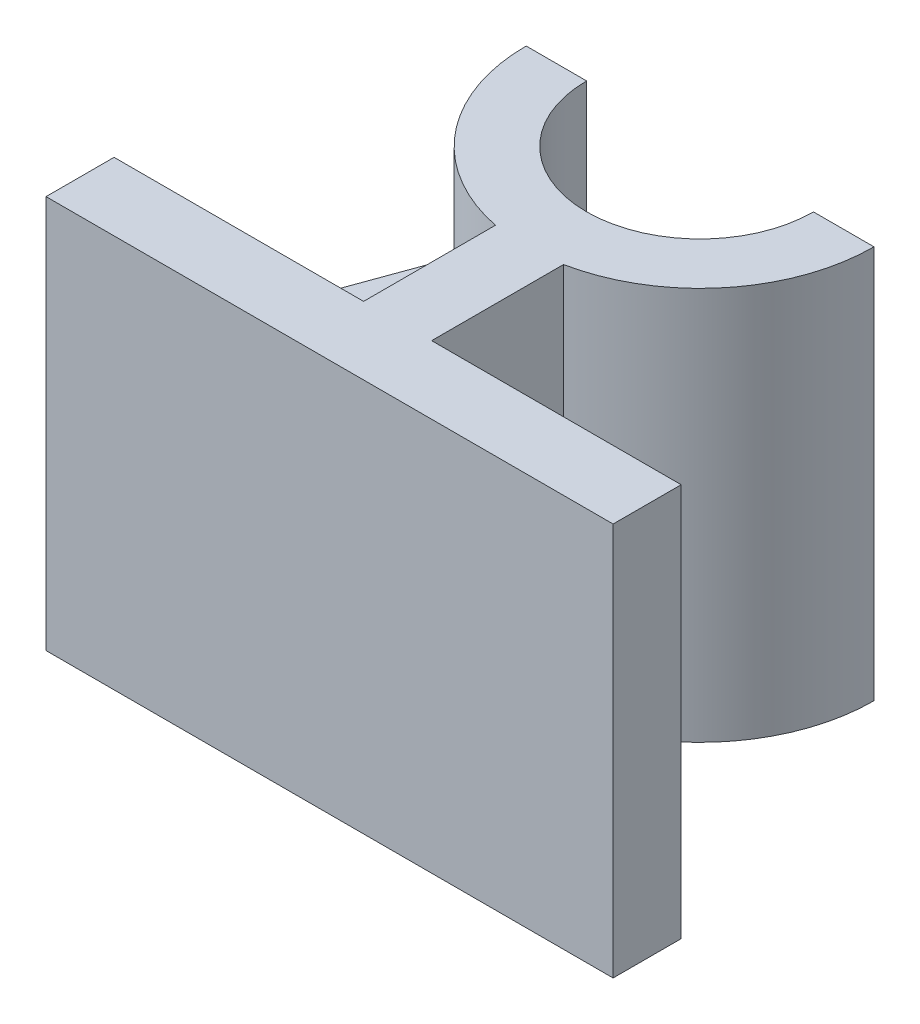
ISO-10303-21;
HEADER;
FILE_DESCRIPTION(('STEP AP214'),'2;1');
FILE_NAME('part.step','',(''),(''),'','','');
FILE_SCHEMA(('AUTOMOTIVE_DESIGN { 1 0 10303 214 1 1 1 1 }'));
ENDSEC;
DATA;
#1=APPLICATION_CONTEXT('core data for automotive mechanical design processes');
#2=APPLICATION_PROTOCOL_DEFINITION('international standard','automotive_design',2000,#1);
#3=PRODUCT_CONTEXT('',#1,'mechanical');
#4=PRODUCT('Part','Part','',(#3));
#5=PRODUCT_RELATED_PRODUCT_CATEGORY('part','',(#4));
#6=PRODUCT_DEFINITION_FORMATION('','',#4);
#7=PRODUCT_DEFINITION_CONTEXT('part definition',#1,'design');
#8=PRODUCT_DEFINITION('design','',#6,#7);
#9=PRODUCT_DEFINITION_SHAPE('','',#8);
#10=(LENGTH_UNIT() NAMED_UNIT(*) SI_UNIT(.MILLI.,.METRE.));
#11=(NAMED_UNIT(*) PLANE_ANGLE_UNIT() SI_UNIT($,.RADIAN.));
#12=(NAMED_UNIT(*) SI_UNIT($,.STERADIAN.) SOLID_ANGLE_UNIT());
#13=UNCERTAINTY_MEASURE_WITH_UNIT(LENGTH_MEASURE(1.E-05),#10,'distance_accuracy_value','');
#14=(GEOMETRIC_REPRESENTATION_CONTEXT(3) GLOBAL_UNCERTAINTY_ASSIGNED_CONTEXT((#13)) GLOBAL_UNIT_ASSIGNED_CONTEXT((#10,
#11,#12)) REPRESENTATION_CONTEXT('',''));
#15=CARTESIAN_POINT('',(0.,0.,0.));
#16=DIRECTION('',(0.,0.,1.));
#17=DIRECTION('',(1.,0.,0.));
#18=AXIS2_PLACEMENT_3D('',#15,#16,#17);
#19=CARTESIAN_POINT('',(0.,-52.,-4.5));
#20=DIRECTION('',(0.,0.,1.));
#21=DIRECTION('',(1.,0.,0.));
#22=AXIS2_PLACEMENT_3D('',#19,#20,#21);
#23=PLANE('',#22);
#24=DIRECTION('',(-1.,0.,0.));
#25=VECTOR('',#24,1.);
#26=CARTESIAN_POINT('',(-37.5,-22.,-4.5));
#27=LINE('',#26,#25);
#28=CARTESIAN_POINT('',(-4.5,-22.,-4.5));
#29=VERTEX_POINT('',#28);
#30=CARTESIAN_POINT('',(-37.5,-22.,-4.5));
#31=VERTEX_POINT('',#30);
#32=EDGE_CURVE('E63',#29,#31,#27,.T.);
#33=ORIENTED_EDGE('',*,*,#32,.T.);
#34=DIRECTION('',(0.,1.,0.));
#35=VECTOR('',#34,1.);
#36=CARTESIAN_POINT('',(-37.5,-52.,-4.5));
#37=LINE('',#36,#35);
#38=CARTESIAN_POINT('',(-37.5,0.,-4.5));
#39=VERTEX_POINT('',#38);
#40=EDGE_CURVE('E315',#31,#39,#37,.T.);
#41=ORIENTED_EDGE('',*,*,#40,.T.);
#42=DIRECTION('',(1.,0.,0.));
#43=VECTOR('',#42,1.);
#44=CARTESIAN_POINT('',(0.,0.,-4.5));
#45=LINE('',#44,#43);
#46=CARTESIAN_POINT('',(-4.5,0.,-4.5));
#47=VERTEX_POINT('',#46);
#48=EDGE_CURVE('E259',#39,#47,#45,.T.);
#49=ORIENTED_EDGE('',*,*,#48,.T.);
#50=DIRECTION('',(0.,1.,0.));
#51=VECTOR('',#50,1.);
#52=CARTESIAN_POINT('',(-4.5,-52.,-4.5));
#53=LINE('',#52,#51);
#54=EDGE_CURVE('E173',#29,#47,#53,.T.);
#55=ORIENTED_EDGE('',*,*,#54,.F.);
#56=EDGE_LOOP('',(#33,#41,#49,#55));
#57=FACE_BOUND('',#56,.T.);
#58=ADVANCED_FACE('F45',(#57),#23,.F.);
#59=CARTESIAN_POINT('',(-4.5,-52.,0.));
#60=DIRECTION('',(1.,0.,0.));
#61=DIRECTION('',(0.,0.,-1.));
#62=AXIS2_PLACEMENT_3D('',#59,#60,#61);
#63=PLANE('',#62);
#64=DIRECTION('',(0.,0.,1.));
#65=VECTOR('',#64,1.);
#66=CARTESIAN_POINT('',(-4.5,-22.,-4.5));
#67=LINE('',#66,#65);
#68=CARTESIAN_POINT('',(-4.5,-22.,-21.9445128627201));
#69=VERTEX_POINT('',#68);
#70=EDGE_CURVE('E324',#69,#29,#67,.T.);
#71=ORIENTED_EDGE('',*,*,#70,.T.);
#72=ORIENTED_EDGE('',*,*,#54,.T.);
#73=DIRECTION('',(0.,0.,-1.));
#74=VECTOR('',#73,1.);
#75=CARTESIAN_POINT('',(-4.5,0.,0.));
#76=LINE('',#75,#74);
#77=CARTESIAN_POINT('',(-4.5,0.,-21.9445128627201));
#78=VERTEX_POINT('',#77);
#79=EDGE_CURVE('E255',#47,#78,#76,.T.);
#80=ORIENTED_EDGE('',*,*,#79,.T.);
#81=DIRECTION('',(0.,1.,0.));
#82=VECTOR('',#81,1.);
#83=CARTESIAN_POINT('',(-4.5,-52.,-21.9445128627201));
#84=LINE('',#83,#82);
#85=EDGE_CURVE('E174',#69,#78,#84,.T.);
#86=ORIENTED_EDGE('',*,*,#85,.F.);
#87=EDGE_LOOP('',(#71,#72,#80,#86));
#88=FACE_BOUND('',#87,.T.);
#89=ADVANCED_FACE('F320',(#88),#63,.F.);
#90=CARTESIAN_POINT('',(0.,-52.,-44.5));
#91=DIRECTION('',(0.,1.,0.));
#92=DIRECTION('',(0.,0.,1.));
#93=AXIS2_PLACEMENT_3D('',#90,#91,#92);
#94=CYLINDRICAL_SURFACE('',#93,23.);
#95=DIRECTION('',(0.,1.,0.));
#96=VECTOR('',#95,1.);
#97=CARTESIAN_POINT('',(-23.,-52.,-44.4999999999998));
#98=LINE('',#97,#96);
#99=CARTESIAN_POINT('',(-23.,-22.,-44.4999999999998));
#100=VERTEX_POINT('',#99);
#101=CARTESIAN_POINT('',(-23.,0.,-44.4999999999998));
#102=VERTEX_POINT('',#101);
#103=EDGE_CURVE('E247',#100,#102,#98,.T.);
#104=ORIENTED_EDGE('',*,*,#103,.F.);
#105=CARTESIAN_POINT('',(0.,-22.,-44.4999999999998));
#106=DIRECTION('',(0.,1.,0.));
#107=DIRECTION('',(0.,0.,-1.));
#108=AXIS2_PLACEMENT_3D('',#105,#106,#107);
#109=CIRCLE('',#108,22.9999999999999);
#110=EDGE_CURVE('E200',#100,#69,#109,.T.);
#111=ORIENTED_EDGE('',*,*,#110,.T.);
#112=ORIENTED_EDGE('',*,*,#85,.T.);
#113=CARTESIAN_POINT('',(0.,0.,-44.5));
#114=DIRECTION('',(0.,1.,0.));
#115=DIRECTION('',(0.,0.,1.));
#116=AXIS2_PLACEMENT_3D('',#113,#114,#115);
#117=CIRCLE('',#116,23.);
#118=EDGE_CURVE('E251',#102,#78,#117,.T.);
#119=ORIENTED_EDGE('',*,*,#118,.F.);
#120=EDGE_LOOP('',(#104,#111,#112,#119));
#121=FACE_BOUND('',#120,.T.);
#122=ADVANCED_FACE('F332',(#121),#94,.T.);
#123=CARTESIAN_POINT('',(-1.15792792021452E-13,-52.,-44.4999999999999));
#124=DIRECTION('',(0.,0.,1.));
#125=DIRECTION('',(1.,0.,0.));
#126=AXIS2_PLACEMENT_3D('',#123,#124,#125);
#127=PLANE('',#126);
#128=DIRECTION('',(1.,0.,0.));
#129=VECTOR('',#128,1.);
#130=CARTESIAN_POINT('',(-1.15792792021452E-13,0.,-44.4999999999999));
#131=LINE('',#130,#129);
#132=CARTESIAN_POINT('',(-15.,0.,-44.4999999999999));
#133=VERTEX_POINT('',#132);
#134=EDGE_CURVE('E205',#102,#133,#131,.T.);
#135=ORIENTED_EDGE('',*,*,#134,.T.);
#136=DIRECTION('',(0.,1.,0.));
#137=VECTOR('',#136,1.);
#138=CARTESIAN_POINT('',(-15.,-52.,-44.4999999999999));
#139=LINE('',#138,#137);
#140=CARTESIAN_POINT('',(-15.,-52.,-44.4999999999999));
#141=VERTEX_POINT('',#140);
#142=EDGE_CURVE('E11',#141,#133,#139,.T.);
#143=ORIENTED_EDGE('',*,*,#142,.F.);
#144=DIRECTION('',(1.,0.,0.));
#145=VECTOR('',#144,1.);
#146=CARTESIAN_POINT('',(-1.15792792021452E-13,-52.,-44.4999999999999));
#147=LINE('',#146,#145);
#148=CARTESIAN_POINT('',(-23.,-52.,-44.4999999999998));
#149=VERTEX_POINT('',#148);
#150=EDGE_CURVE('E208',#149,#141,#147,.T.);
#151=ORIENTED_EDGE('',*,*,#150,.F.);
#152=CARTESIAN_POINT('',(-23.,-30.,-44.4999999999998));
#153=VERTEX_POINT('',#152);
#154=EDGE_CURVE('E49',#149,#153,#98,.T.);
#155=ORIENTED_EDGE('',*,*,#154,.T.);
#156=DIRECTION('',(0.,-1.,0.));
#157=VECTOR('',#156,1.);
#158=CARTESIAN_POINT('',(-23.,-22.,-44.4999999999998));
#159=LINE('',#158,#157);
#160=EDGE_CURVE('E201',#100,#153,#159,.T.);
#161=ORIENTED_EDGE('',*,*,#160,.F.);
#162=ORIENTED_EDGE('',*,*,#103,.T.);
#163=EDGE_LOOP('',(#135,#143,#151,#155,#161,#162));
#164=FACE_BOUND('',#163,.T.);
#165=ADVANCED_FACE('F47',(#164),#127,.F.);
#166=CARTESIAN_POINT('',(0.,-52.,-44.5));
#167=DIRECTION('',(0.,1.,0.));
#168=DIRECTION('',(0.,0.,1.));
#169=AXIS2_PLACEMENT_3D('',#166,#167,#168);
#170=CYLINDRICAL_SURFACE('',#169,15.);
#171=CARTESIAN_POINT('',(0.,0.,-44.5));
#172=DIRECTION('',(0.,1.,0.));
#173=DIRECTION('',(0.,0.,1.));
#174=AXIS2_PLACEMENT_3D('',#171,#172,#173);
#175=CIRCLE('',#174,15.);
#176=CARTESIAN_POINT('',(15.,0.,-44.5));
#177=VERTEX_POINT('',#176);
#178=EDGE_CURVE('E212',#133,#177,#175,.T.);
#179=ORIENTED_EDGE('',*,*,#178,.T.);
#180=DIRECTION('',(0.,1.,0.));
#181=VECTOR('',#180,1.);
#182=CARTESIAN_POINT('',(15.,-52.,-44.5));
#183=LINE('',#182,#181);
#184=CARTESIAN_POINT('',(15.,-52.,-44.5));
#185=VERTEX_POINT('',#184);
#186=EDGE_CURVE('E55',#185,#177,#183,.T.);
#187=ORIENTED_EDGE('',*,*,#186,.F.);
#188=CARTESIAN_POINT('',(0.,-52.,-44.5));
#189=DIRECTION('',(0.,1.,0.));
#190=DIRECTION('',(0.,0.,1.));
#191=AXIS2_PLACEMENT_3D('',#188,#189,#190);
#192=CIRCLE('',#191,15.);
#193=EDGE_CURVE('E244',#141,#185,#192,.T.);
#194=ORIENTED_EDGE('',*,*,#193,.F.);
#195=ORIENTED_EDGE('',*,*,#142,.T.);
#196=EDGE_LOOP('',(#179,#187,#194,#195));
#197=FACE_BOUND('',#196,.T.);
#198=ADVANCED_FACE('F380',(#197),#170,.F.);
#199=CARTESIAN_POINT('',(-1.54390389361936E-13,-52.,-44.4999999999999));
#200=DIRECTION('',(0.,0.,1.));
#201=DIRECTION('',(1.,0.,0.));
#202=AXIS2_PLACEMENT_3D('',#199,#200,#201);
#203=PLANE('',#202);
#204=DIRECTION('',(1.,0.,0.));
#205=VECTOR('',#204,1.);
#206=CARTESIAN_POINT('',(-1.54390389361936E-13,0.,-44.4999999999999));
#207=LINE('',#206,#205);
#208=CARTESIAN_POINT('',(23.,0.,-44.5));
#209=VERTEX_POINT('',#208);
#210=EDGE_CURVE('E284',#177,#209,#207,.T.);
#211=ORIENTED_EDGE('',*,*,#210,.T.);
#212=DIRECTION('',(0.,1.,0.));
#213=VECTOR('',#212,1.);
#214=CARTESIAN_POINT('',(23.,-52.,-44.5));
#215=LINE('',#214,#213);
#216=CARTESIAN_POINT('',(23.,-52.,-44.5));
#217=VERTEX_POINT('',#216);
#218=EDGE_CURVE('E293',#217,#209,#215,.T.);
#219=ORIENTED_EDGE('',*,*,#218,.F.);
#220=DIRECTION('',(1.,0.,0.));
#221=VECTOR('',#220,1.);
#222=CARTESIAN_POINT('',(-1.54390389361936E-13,-52.,-44.4999999999999));
#223=LINE('',#222,#221);
#224=EDGE_CURVE('E241',#185,#217,#223,.T.);
#225=ORIENTED_EDGE('',*,*,#224,.F.);
#226=ORIENTED_EDGE('',*,*,#186,.T.);
#227=EDGE_LOOP('',(#211,#219,#225,#226));
#228=FACE_BOUND('',#227,.T.);
#229=ADVANCED_FACE('F385',(#228),#203,.F.);
#230=CARTESIAN_POINT('',(0.,-52.,-44.5));
#231=DIRECTION('',(0.,1.,0.));
#232=DIRECTION('',(0.,0.,1.));
#233=AXIS2_PLACEMENT_3D('',#230,#231,#232);
#234=CYLINDRICAL_SURFACE('',#233,23.);
#235=CARTESIAN_POINT('',(0.,0.,-44.5));
#236=DIRECTION('',(0.,1.,0.));
#237=DIRECTION('',(0.,0.,1.));
#238=AXIS2_PLACEMENT_3D('',#235,#236,#237);
#239=CIRCLE('',#238,23.);
#240=CARTESIAN_POINT('',(4.5,0.,-21.9445128627201));
#241=VERTEX_POINT('',#240);
#242=EDGE_CURVE('E280',#241,#209,#239,.T.);
#243=ORIENTED_EDGE('',*,*,#242,.F.);
#244=DIRECTION('',(0.,1.,0.));
#245=VECTOR('',#244,1.);
#246=CARTESIAN_POINT('',(4.5,-52.,-21.9445128627201));
#247=LINE('',#246,#245);
#248=CARTESIAN_POINT('',(4.5,-52.,-21.9445128627201));
#249=VERTEX_POINT('',#248);
#250=EDGE_CURVE('E296',#249,#241,#247,.T.);
#251=ORIENTED_EDGE('',*,*,#250,.F.);
#252=CARTESIAN_POINT('',(0.,-52.,-44.5));
#253=DIRECTION('',(0.,1.,0.));
#254=DIRECTION('',(0.,0.,1.));
#255=AXIS2_PLACEMENT_3D('',#252,#253,#254);
#256=CIRCLE('',#255,23.);
#257=EDGE_CURVE('E237',#249,#217,#256,.T.);
#258=ORIENTED_EDGE('',*,*,#257,.T.);
#259=ORIENTED_EDGE('',*,*,#218,.T.);
#260=EDGE_LOOP('',(#243,#251,#258,#259));
#261=FACE_BOUND('',#260,.T.);
#262=ADVANCED_FACE('F391',(#261),#234,.T.);
#263=CARTESIAN_POINT('',(4.5,-52.,0.));
#264=DIRECTION('',(1.,0.,0.));
#265=DIRECTION('',(0.,0.,-1.));
#266=AXIS2_PLACEMENT_3D('',#263,#264,#265);
#267=PLANE('',#266);
#268=DIRECTION('',(0.,0.,-1.));
#269=VECTOR('',#268,1.);
#270=CARTESIAN_POINT('',(4.5,0.,0.));
#271=LINE('',#270,#269);
#272=CARTESIAN_POINT('',(4.5,0.,-4.5));
#273=VERTEX_POINT('',#272);
#274=EDGE_CURVE('E276',#273,#241,#271,.T.);
#275=ORIENTED_EDGE('',*,*,#274,.F.);
#276=DIRECTION('',(0.,1.,0.));
#277=VECTOR('',#276,1.);
#278=CARTESIAN_POINT('',(4.5,-52.,-4.5));
#279=LINE('',#278,#277);
#280=CARTESIAN_POINT('',(4.5,-52.,-4.5));
#281=VERTEX_POINT('',#280);
#282=EDGE_CURVE('E299',#281,#273,#279,.T.);
#283=ORIENTED_EDGE('',*,*,#282,.F.);
#284=DIRECTION('',(0.,0.,-1.));
#285=VECTOR('',#284,1.);
#286=CARTESIAN_POINT('',(4.5,-52.,0.));
#287=LINE('',#286,#285);
#288=EDGE_CURVE('E233',#281,#249,#287,.T.);
#289=ORIENTED_EDGE('',*,*,#288,.T.);
#290=ORIENTED_EDGE('',*,*,#250,.T.);
#291=EDGE_LOOP('',(#275,#283,#289,#290));
#292=FACE_BOUND('',#291,.T.);
#293=ADVANCED_FACE('F389',(#292),#267,.T.);
#294=CARTESIAN_POINT('',(37.5,0.,-4.5));
#295=VERTEX_POINT('',#294);
#296=EDGE_CURVE('E264',#273,#295,#45,.T.);
#297=ORIENTED_EDGE('',*,*,#296,.T.);
#298=DIRECTION('',(0.,1.,0.));
#299=VECTOR('',#298,1.);
#300=CARTESIAN_POINT('',(37.5,-52.,-4.5));
#301=LINE('',#300,#299);
#302=CARTESIAN_POINT('',(37.5,-52.,-4.5));
#303=VERTEX_POINT('',#302);
#304=EDGE_CURVE('E302',#303,#295,#301,.T.);
#305=ORIENTED_EDGE('',*,*,#304,.F.);
#306=DIRECTION('',(1.,0.,0.));
#307=VECTOR('',#306,1.);
#308=CARTESIAN_POINT('',(0.,-52.,-4.5));
#309=LINE('',#308,#307);
#310=EDGE_CURVE('E222',#281,#303,#309,.T.);
#311=ORIENTED_EDGE('',*,*,#310,.F.);
#312=ORIENTED_EDGE('',*,*,#282,.T.);
#313=EDGE_LOOP('',(#297,#305,#311,#312));
#314=FACE_BOUND('',#313,.T.);
#315=ADVANCED_FACE('F365',(#314),#23,.F.);
#316=CARTESIAN_POINT('',(37.5,-52.,0.));
#317=DIRECTION('',(-1.,0.,0.));
#318=DIRECTION('',(0.,0.,1.));
#319=AXIS2_PLACEMENT_3D('',#316,#317,#318);
#320=PLANE('',#319);
#321=DIRECTION('',(0.,0.,1.));
#322=VECTOR('',#321,1.);
#323=CARTESIAN_POINT('',(37.5,0.,0.));
#324=LINE('',#323,#322);
#325=CARTESIAN_POINT('',(37.5,0.,4.5));
#326=VERTEX_POINT('',#325);
#327=EDGE_CURVE('E272',#295,#326,#324,.T.);
#328=ORIENTED_EDGE('',*,*,#327,.T.);
#329=DIRECTION('',(0.,1.,0.));
#330=VECTOR('',#329,1.);
#331=CARTESIAN_POINT('',(37.5,-52.,4.5));
#332=LINE('',#331,#330);
#333=CARTESIAN_POINT('',(37.5,-52.,4.5));
#334=VERTEX_POINT('',#333);
#335=EDGE_CURVE('E306',#334,#326,#332,.T.);
#336=ORIENTED_EDGE('',*,*,#335,.F.);
#337=DIRECTION('',(0.,0.,1.));
#338=VECTOR('',#337,1.);
#339=CARTESIAN_POINT('',(37.5,-52.,0.));
#340=LINE('',#339,#338);
#341=EDGE_CURVE('E230',#303,#334,#340,.T.);
#342=ORIENTED_EDGE('',*,*,#341,.F.);
#343=ORIENTED_EDGE('',*,*,#304,.T.);
#344=EDGE_LOOP('',(#328,#336,#342,#343));
#345=FACE_BOUND('',#344,.T.);
#346=ADVANCED_FACE('F369',(#345),#320,.F.);
#347=CARTESIAN_POINT('',(0.,-52.,4.5));
#348=DIRECTION('',(0.,0.,1.));
#349=DIRECTION('',(1.,0.,0.));
#350=AXIS2_PLACEMENT_3D('',#347,#348,#349);
#351=PLANE('',#350);
#352=DIRECTION('',(1.,0.,0.));
#353=VECTOR('',#352,1.);
#354=CARTESIAN_POINT('',(0.,0.,4.5));
#355=LINE('',#354,#353);
#356=CARTESIAN_POINT('',(-37.5,0.,4.5));
#357=VERTEX_POINT('',#356);
#358=EDGE_CURVE('E268',#357,#326,#355,.T.);
#359=ORIENTED_EDGE('',*,*,#358,.F.);
#360=DIRECTION('',(0.,1.,0.));
#361=VECTOR('',#360,1.);
#362=CARTESIAN_POINT('',(-37.5,-52.,4.5));
#363=LINE('',#362,#361);
#364=CARTESIAN_POINT('',(-37.5,-52.,4.5));
#365=VERTEX_POINT('',#364);
#366=EDGE_CURVE('E309',#365,#357,#363,.T.);
#367=ORIENTED_EDGE('',*,*,#366,.F.);
#368=DIRECTION('',(1.,0.,0.));
#369=VECTOR('',#368,1.);
#370=CARTESIAN_POINT('',(0.,-52.,4.5));
#371=LINE('',#370,#369);
#372=EDGE_CURVE('E226',#365,#334,#371,.T.);
#373=ORIENTED_EDGE('',*,*,#372,.T.);
#374=ORIENTED_EDGE('',*,*,#335,.T.);
#375=EDGE_LOOP('',(#359,#367,#373,#374));
#376=FACE_BOUND('',#375,.T.);
#377=ADVANCED_FACE('F372',(#376),#351,.T.);
#378=CARTESIAN_POINT('',(-37.5,-52.,0.));
#379=DIRECTION('',(-1.,0.,0.));
#380=DIRECTION('',(0.,0.,1.));
#381=AXIS2_PLACEMENT_3D('',#378,#379,#380);
#382=PLANE('',#381);
#383=DIRECTION('',(0.,0.,1.));
#384=VECTOR('',#383,1.);
#385=CARTESIAN_POINT('',(-37.5,0.,0.));
#386=LINE('',#385,#384);
#387=EDGE_CURVE('E263',#39,#357,#386,.T.);
#388=ORIENTED_EDGE('',*,*,#387,.F.);
#389=ORIENTED_EDGE('',*,*,#40,.F.);
#390=DIRECTION('',(0.,-1.,0.));
#391=VECTOR('',#390,1.);
#392=CARTESIAN_POINT('',(-37.5,-22.,-4.5));
#393=LINE('',#392,#391);
#394=CARTESIAN_POINT('',(-37.5,-30.,-4.5));
#395=VERTEX_POINT('',#394);
#396=EDGE_CURVE('E70',#31,#395,#393,.T.);
#397=ORIENTED_EDGE('',*,*,#396,.T.);
#398=CARTESIAN_POINT('',(-37.5,-52.,-4.5));
#399=VERTEX_POINT('',#398);
#400=EDGE_CURVE('E312',#399,#395,#37,.T.);
#401=ORIENTED_EDGE('',*,*,#400,.F.);
#402=DIRECTION('',(0.,0.,1.));
#403=VECTOR('',#402,1.);
#404=CARTESIAN_POINT('',(-37.5,-52.,0.));
#405=LINE('',#404,#403);
#406=EDGE_CURVE('E221',#399,#365,#405,.T.);
#407=ORIENTED_EDGE('',*,*,#406,.T.);
#408=ORIENTED_EDGE('',*,*,#366,.T.);
#409=EDGE_LOOP('',(#388,#389,#397,#401,#407,#408));
#410=FACE_BOUND('',#409,.T.);
#411=ADVANCED_FACE('F374',(#410),#382,.T.);
#412=ORIENTED_EDGE('',*,*,#400,.T.);
#413=DIRECTION('',(-1.,0.,0.));
#414=VECTOR('',#413,1.);
#415=CARTESIAN_POINT('',(-37.5,-30.,-4.5));
#416=LINE('',#415,#414);
#417=CARTESIAN_POINT('',(-4.5,-30.,-4.5));
#418=VERTEX_POINT('',#417);
#419=EDGE_CURVE('E184',#418,#395,#416,.T.);
#420=ORIENTED_EDGE('',*,*,#419,.F.);
#421=CARTESIAN_POINT('',(-4.5,-52.,-4.5));
#422=VERTEX_POINT('',#421);
#423=EDGE_CURVE('E180',#422,#418,#53,.T.);
#424=ORIENTED_EDGE('',*,*,#423,.F.);
#425=EDGE_CURVE('E218',#399,#422,#309,.T.);
#426=ORIENTED_EDGE('',*,*,#425,.F.);
#427=EDGE_LOOP('',(#412,#420,#424,#426));
#428=FACE_BOUND('',#427,.T.);
#429=ADVANCED_FACE('F377',(#428),#23,.F.);
#430=ORIENTED_EDGE('',*,*,#423,.T.);
#431=DIRECTION('',(0.,0.,1.));
#432=VECTOR('',#431,1.);
#433=CARTESIAN_POINT('',(-4.5,-30.,-4.5));
#434=LINE('',#433,#432);
#435=CARTESIAN_POINT('',(-4.5,-30.,-21.9445128627201));
#436=VERTEX_POINT('',#435);
#437=EDGE_CURVE('E177',#436,#418,#434,.T.);
#438=ORIENTED_EDGE('',*,*,#437,.F.);
#439=CARTESIAN_POINT('',(-4.5,-52.,-21.9445128627201));
#440=VERTEX_POINT('',#439);
#441=EDGE_CURVE('E162',#440,#436,#84,.T.);
#442=ORIENTED_EDGE('',*,*,#441,.F.);
#443=DIRECTION('',(0.,0.,-1.));
#444=VECTOR('',#443,1.);
#445=CARTESIAN_POINT('',(-4.5,-52.,0.));
#446=LINE('',#445,#444);
#447=EDGE_CURVE('E215',#422,#440,#446,.T.);
#448=ORIENTED_EDGE('',*,*,#447,.F.);
#449=EDGE_LOOP('',(#430,#438,#442,#448));
#450=FACE_BOUND('',#449,.T.);
#451=ADVANCED_FACE('F178',(#450),#63,.F.);
#452=CARTESIAN_POINT('',(0.,-30.,-44.4999999999998));
#453=DIRECTION('',(0.,1.,0.));
#454=DIRECTION('',(0.,0.,-1.));
#455=AXIS2_PLACEMENT_3D('',#452,#453,#454);
#456=CIRCLE('',#455,22.9999999999999);
#457=EDGE_CURVE('E166',#153,#436,#456,.T.);
#458=ORIENTED_EDGE('',*,*,#457,.F.);
#459=ORIENTED_EDGE('',*,*,#154,.F.);
#460=CARTESIAN_POINT('',(0.,-52.,-44.5));
#461=DIRECTION('',(0.,1.,0.));
#462=DIRECTION('',(0.,0.,1.));
#463=AXIS2_PLACEMENT_3D('',#460,#461,#462);
#464=CIRCLE('',#463,23.);
#465=EDGE_CURVE('E169',#149,#440,#464,.T.);
#466=ORIENTED_EDGE('',*,*,#465,.T.);
#467=ORIENTED_EDGE('',*,*,#441,.T.);
#468=EDGE_LOOP('',(#458,#459,#466,#467));
#469=FACE_BOUND('',#468,.T.);
#470=ADVANCED_FACE('F164',(#469),#94,.T.);
#471=CARTESIAN_POINT('',(0.,-52.,0.));
#472=DIRECTION('',(0.,1.,0.));
#473=DIRECTION('',(0.,0.,1.));
#474=AXIS2_PLACEMENT_3D('',#471,#472,#473);
#475=PLANE('',#474);
#476=ORIENTED_EDGE('',*,*,#150,.T.);
#477=ORIENTED_EDGE('',*,*,#193,.T.);
#478=ORIENTED_EDGE('',*,*,#224,.T.);
#479=ORIENTED_EDGE('',*,*,#257,.F.);
#480=ORIENTED_EDGE('',*,*,#288,.F.);
#481=ORIENTED_EDGE('',*,*,#310,.T.);
#482=ORIENTED_EDGE('',*,*,#341,.T.);
#483=ORIENTED_EDGE('',*,*,#372,.F.);
#484=ORIENTED_EDGE('',*,*,#406,.F.);
#485=ORIENTED_EDGE('',*,*,#425,.T.);
#486=ORIENTED_EDGE('',*,*,#447,.T.);
#487=ORIENTED_EDGE('',*,*,#465,.F.);
#488=EDGE_LOOP('',(#476,#477,#478,#479,#480,#481,#482,#483,#484,#485,#486,#487));
#489=FACE_BOUND('',#488,.T.);
#490=ADVANCED_FACE('F359',(#489),#475,.F.);
#491=CARTESIAN_POINT('',(0.,0.,0.));
#492=DIRECTION('',(0.,1.,0.));
#493=DIRECTION('',(0.,0.,1.));
#494=AXIS2_PLACEMENT_3D('',#491,#492,#493);
#495=PLANE('',#494);
#496=ORIENTED_EDGE('',*,*,#134,.F.);
#497=ORIENTED_EDGE('',*,*,#118,.T.);
#498=ORIENTED_EDGE('',*,*,#79,.F.);
#499=ORIENTED_EDGE('',*,*,#48,.F.);
#500=ORIENTED_EDGE('',*,*,#387,.T.);
#501=ORIENTED_EDGE('',*,*,#358,.T.);
#502=ORIENTED_EDGE('',*,*,#327,.F.);
#503=ORIENTED_EDGE('',*,*,#296,.F.);
#504=ORIENTED_EDGE('',*,*,#274,.T.);
#505=ORIENTED_EDGE('',*,*,#242,.T.);
#506=ORIENTED_EDGE('',*,*,#210,.F.);
#507=ORIENTED_EDGE('',*,*,#178,.F.);
#508=EDGE_LOOP('',(#496,#497,#498,#499,#500,#501,#502,#503,#504,#505,#506,#507));
#509=FACE_BOUND('',#508,.T.);
#510=ADVANCED_FACE('F329',(#509),#495,.T.);
#511=CARTESIAN_POINT('',(-23.,-22.,-44.4999999999998));
#512=DIRECTION('',(-0.940136065162482,0.,-0.340799323621401));
#513=DIRECTION('',(-0.340799323621401,0.,0.940136065162483));
#514=AXIS2_PLACEMENT_3D('',#511,#512,#513);
#515=PLANE('',#514);
#516=DIRECTION('',(0.340799323621401,0.,-0.940136065162483));
#517=VECTOR('',#516,1.);
#518=CARTESIAN_POINT('',(-23.,-30.,-44.4999999999998));
#519=LINE('',#518,#517);
#520=EDGE_CURVE('E189',#395,#153,#519,.T.);
#521=ORIENTED_EDGE('',*,*,#520,.F.);
#522=ORIENTED_EDGE('',*,*,#396,.F.);
#523=DIRECTION('',(0.340799323621401,0.,-0.940136065162483));
#524=VECTOR('',#523,1.);
#525=CARTESIAN_POINT('',(-23.,-22.,-44.4999999999998));
#526=LINE('',#525,#524);
#527=EDGE_CURVE('E193',#31,#100,#526,.T.);
#528=ORIENTED_EDGE('',*,*,#527,.T.);
#529=ORIENTED_EDGE('',*,*,#160,.T.);
#530=EDGE_LOOP('',(#521,#522,#528,#529));
#531=FACE_BOUND('',#530,.T.);
#532=ADVANCED_FACE('F348',(#531),#515,.T.);
#533=CARTESIAN_POINT('',(0.,-22.,-44.4999999999998));
#534=DIRECTION('',(0.,-1.,0.));
#535=DIRECTION('',(0.,0.,-1.));
#536=AXIS2_PLACEMENT_3D('',#533,#534,#535);
#537=PLANE('',#536);
#538=ORIENTED_EDGE('',*,*,#110,.F.);
#539=ORIENTED_EDGE('',*,*,#527,.F.);
#540=ORIENTED_EDGE('',*,*,#32,.F.);
#541=ORIENTED_EDGE('',*,*,#70,.F.);
#542=EDGE_LOOP('',(#538,#539,#540,#541));
#543=FACE_BOUND('',#542,.T.);
#544=ADVANCED_FACE('F345',(#543),#537,.F.);
#545=CARTESIAN_POINT('',(0.,-30.,-44.4999999999998));
#546=DIRECTION('',(0.,-1.,0.));
#547=DIRECTION('',(0.,0.,-1.));
#548=AXIS2_PLACEMENT_3D('',#545,#546,#547);
#549=PLANE('',#548);
#550=ORIENTED_EDGE('',*,*,#457,.T.);
#551=ORIENTED_EDGE('',*,*,#437,.T.);
#552=ORIENTED_EDGE('',*,*,#419,.T.);
#553=ORIENTED_EDGE('',*,*,#520,.T.);
#554=EDGE_LOOP('',(#550,#551,#552,#553));
#555=FACE_BOUND('',#554,.T.);
#556=ADVANCED_FACE('F187',(#555),#549,.T.);
#557=CLOSED_SHELL('',(#58,#89,#122,#165,#198,#229,#262,#293,#315,#346,#377,#411,#429,#451,#470,
#490,#510,#532,#544,#556));
#558=MANIFOLD_SOLID_BREP('B2',#557);
#559=ADVANCED_BREP_SHAPE_REPRESENTATION('',(#18,#558),#14);
#560=SHAPE_DEFINITION_REPRESENTATION(#9,#559);
ENDSEC;
END-ISO-10303-21;
